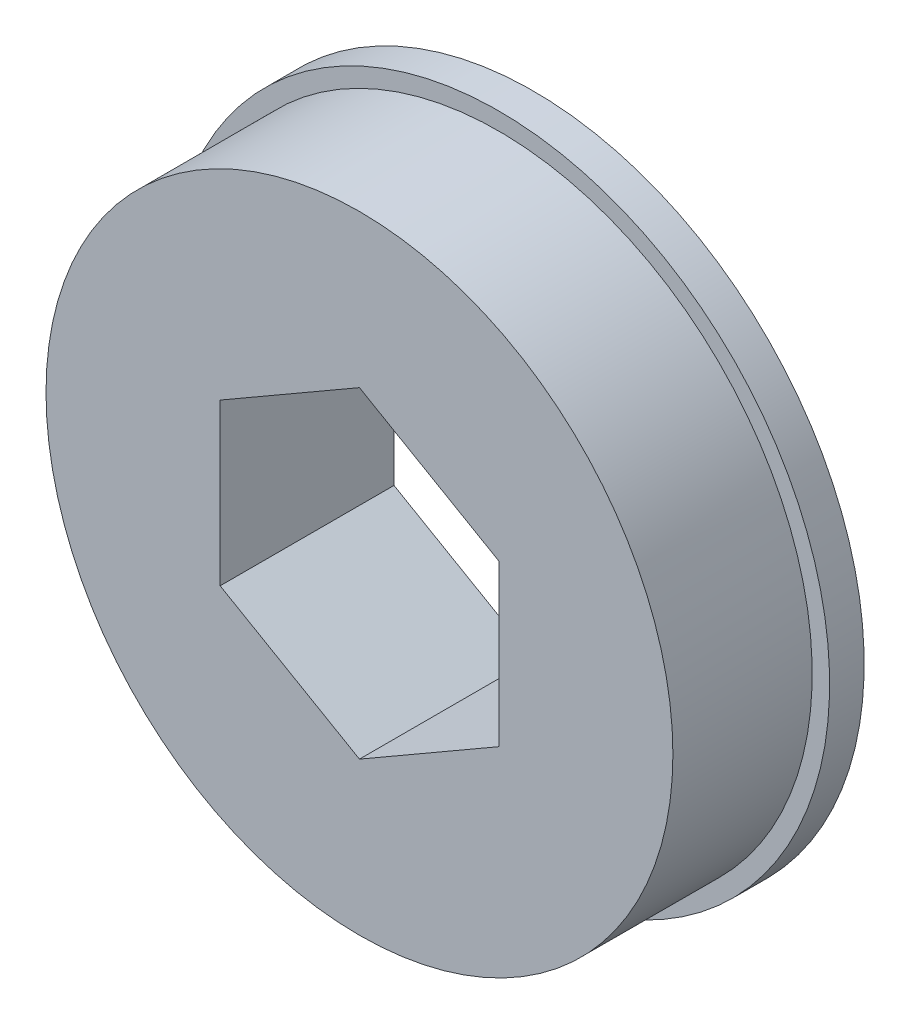
ISO-10303-21;
HEADER;
FILE_DESCRIPTION(('STEP AP214'),'2;1');
FILE_NAME('part.step','',(''),(''),'','','');
FILE_SCHEMA(('AUTOMOTIVE_DESIGN { 1 0 10303 214 1 1 1 1 }'));
ENDSEC;
DATA;
#1=APPLICATION_CONTEXT('core data for automotive mechanical design processes');
#2=APPLICATION_PROTOCOL_DEFINITION('international standard','automotive_design',2000,#1);
#3=PRODUCT_CONTEXT('',#1,'mechanical');
#4=PRODUCT('Part','Part','',(#3));
#5=PRODUCT_RELATED_PRODUCT_CATEGORY('part','',(#4));
#6=PRODUCT_DEFINITION_FORMATION('','',#4);
#7=PRODUCT_DEFINITION_CONTEXT('part definition',#1,'design');
#8=PRODUCT_DEFINITION('design','',#6,#7);
#9=PRODUCT_DEFINITION_SHAPE('','',#8);
#10=(LENGTH_UNIT() NAMED_UNIT(*) SI_UNIT(.MILLI.,.METRE.));
#11=(NAMED_UNIT(*) PLANE_ANGLE_UNIT() SI_UNIT($,.RADIAN.));
#12=(NAMED_UNIT(*) SI_UNIT($,.STERADIAN.) SOLID_ANGLE_UNIT());
#13=UNCERTAINTY_MEASURE_WITH_UNIT(LENGTH_MEASURE(1.E-05),#10,'distance_accuracy_value','');
#14=(GEOMETRIC_REPRESENTATION_CONTEXT(3) GLOBAL_UNCERTAINTY_ASSIGNED_CONTEXT((#13)) GLOBAL_UNIT_ASSIGNED_CONTEXT((#10,
#11,#12)) REPRESENTATION_CONTEXT('',''));
#15=CARTESIAN_POINT('',(0.,0.,0.));
#16=DIRECTION('',(0.,0.,1.));
#17=DIRECTION('',(1.,0.,0.));
#18=AXIS2_PLACEMENT_3D('',#15,#16,#17);
#19=CARTESIAN_POINT('',(0.,0.,6.35));
#20=DIRECTION('',(0.,0.,1.));
#21=DIRECTION('',(1.,0.,0.));
#22=AXIS2_PLACEMENT_3D('',#19,#20,#21);
#23=PLANE('',#22);
#24=CARTESIAN_POINT('',(0.,0.,6.35));
#25=DIRECTION('',(0.,0.,1.));
#26=DIRECTION('',(1.,0.,0.));
#27=AXIS2_PLACEMENT_3D('',#24,#25,#26);
#28=CIRCLE('',#27,14.2875);
#29=CARTESIAN_POINT('',(14.2875,0.,6.35));
#30=VERTEX_POINT('',#29);
#31=EDGE_CURVE('E11',#30,#30,#28,.T.);
#32=ORIENTED_EDGE('',*,*,#31,.T.);
#33=EDGE_LOOP('',(#32));
#34=FACE_BOUND('',#33,.T.);
#35=DIRECTION('',(-0.866025403784439,0.5,0.));
#36=VECTOR('',#35,1.);
#37=CARTESIAN_POINT('',(6.35,3.66617420935412,6.35));
#38=LINE('',#37,#36);
#39=CARTESIAN_POINT('',(6.35,3.66617420935412,6.35));
#40=VERTEX_POINT('',#39);
#41=CARTESIAN_POINT('',(0.,7.33234841870825,6.35));
#42=VERTEX_POINT('',#41);
#43=EDGE_CURVE('E93',#40,#42,#38,.T.);
#44=ORIENTED_EDGE('',*,*,#43,.F.);
#45=DIRECTION('',(0.,1.,0.));
#46=VECTOR('',#45,1.);
#47=CARTESIAN_POINT('',(6.35,-3.66617420935412,6.35));
#48=LINE('',#47,#46);
#49=CARTESIAN_POINT('',(6.35,-3.66617420935412,6.35));
#50=VERTEX_POINT('',#49);
#51=EDGE_CURVE('E129',#50,#40,#48,.T.);
#52=ORIENTED_EDGE('',*,*,#51,.F.);
#53=DIRECTION('',(0.866025403784438,0.5,0.));
#54=VECTOR('',#53,1.);
#55=CARTESIAN_POINT('',(0.,-7.33234841870825,6.35));
#56=LINE('',#55,#54);
#57=CARTESIAN_POINT('',(0.,-7.33234841870825,6.35));
#58=VERTEX_POINT('',#57);
#59=EDGE_CURVE('E53',#58,#50,#56,.T.);
#60=ORIENTED_EDGE('',*,*,#59,.F.);
#61=DIRECTION('',(0.866025403784439,-0.5,0.));
#62=VECTOR('',#61,1.);
#63=CARTESIAN_POINT('',(-6.35,-3.66617420935413,6.35));
#64=LINE('',#63,#62);
#65=CARTESIAN_POINT('',(-6.35,-3.66617420935413,6.35));
#66=VERTEX_POINT('',#65);
#67=EDGE_CURVE('E136',#66,#58,#64,.T.);
#68=ORIENTED_EDGE('',*,*,#67,.F.);
#69=DIRECTION('',(0.,-1.,0.));
#70=VECTOR('',#69,1.);
#71=CARTESIAN_POINT('',(-6.35,3.66617420935412,6.35));
#72=LINE('',#71,#70);
#73=CARTESIAN_POINT('',(-6.35,3.66617420935412,6.35));
#74=VERTEX_POINT('',#73);
#75=EDGE_CURVE('E134',#74,#66,#72,.T.);
#76=ORIENTED_EDGE('',*,*,#75,.F.);
#77=DIRECTION('',(-0.866025403784438,-0.500000000000001,0.));
#78=VECTOR('',#77,1.);
#79=CARTESIAN_POINT('',(0.,7.33234841870825,6.35));
#80=LINE('',#79,#78);
#81=EDGE_CURVE('E132',#42,#74,#80,.T.);
#82=ORIENTED_EDGE('',*,*,#81,.F.);
#83=EDGE_LOOP('',(#44,#52,#60,#68,#76,#82));
#84=FACE_BOUND('',#83,.T.);
#85=ADVANCED_FACE('F33',(#34,#84),#23,.T.);
#86=CARTESIAN_POINT('',(0.,0.,6.35));
#87=DIRECTION('',(0.,0.,-1.));
#88=DIRECTION('',(-1.,0.,0.));
#89=AXIS2_PLACEMENT_3D('',#86,#87,#88);
#90=CYLINDRICAL_SURFACE('',#89,14.2875);
#91=ORIENTED_EDGE('',*,*,#31,.F.);
#92=EDGE_LOOP('',(#91));
#93=FACE_BOUND('',#92,.T.);
#94=CARTESIAN_POINT('',(0.,0.,0.));
#95=DIRECTION('',(0.,0.,-1.));
#96=DIRECTION('',(-1.,0.,0.));
#97=AXIS2_PLACEMENT_3D('',#94,#95,#96);
#98=CIRCLE('',#97,14.2875);
#99=CARTESIAN_POINT('',(-14.2875,0.,0.));
#100=VERTEX_POINT('',#99);
#101=EDGE_CURVE('E124',#100,#100,#98,.T.);
#102=ORIENTED_EDGE('',*,*,#101,.F.);
#103=EDGE_LOOP('',(#102));
#104=FACE_BOUND('',#103,.T.);
#105=ADVANCED_FACE('F35',(#93,#104),#90,.T.);
#106=CARTESIAN_POINT('',(6.35,-3.66617420935412,6.35));
#107=DIRECTION('',(-1.,0.,0.));
#108=DIRECTION('',(0.,-1.,0.));
#109=AXIS2_PLACEMENT_3D('',#106,#107,#108);
#110=PLANE('',#109);
#111=DIRECTION('',(0.,0.,-1.));
#112=VECTOR('',#111,1.);
#113=CARTESIAN_POINT('',(6.35,3.66617420935412,6.35));
#114=LINE('',#113,#112);
#115=CARTESIAN_POINT('',(6.35,3.66617420935412,-1.5748));
#116=VERTEX_POINT('',#115);
#117=EDGE_CURVE('E41',#40,#116,#114,.T.);
#118=ORIENTED_EDGE('',*,*,#117,.T.);
#119=DIRECTION('',(0.,-1.,0.));
#120=VECTOR('',#119,1.);
#121=CARTESIAN_POINT('',(6.35,3.66617420935412,-1.5748));
#122=LINE('',#121,#120);
#123=CARTESIAN_POINT('',(6.35,-3.66617420935412,-1.5748));
#124=VERTEX_POINT('',#123);
#125=EDGE_CURVE('E109',#116,#124,#122,.T.);
#126=ORIENTED_EDGE('',*,*,#125,.T.);
#127=DIRECTION('',(0.,0.,-1.));
#128=VECTOR('',#127,1.);
#129=CARTESIAN_POINT('',(6.35,-3.66617420935412,6.35));
#130=LINE('',#129,#128);
#131=EDGE_CURVE('E139',#50,#124,#130,.T.);
#132=ORIENTED_EDGE('',*,*,#131,.F.);
#133=ORIENTED_EDGE('',*,*,#51,.T.);
#134=EDGE_LOOP('',(#118,#126,#132,#133));
#135=FACE_BOUND('',#134,.T.);
#136=ADVANCED_FACE('F145',(#135),#110,.T.);
#137=CARTESIAN_POINT('',(6.35,3.66617420935412,6.35));
#138=DIRECTION('',(-0.5,-0.866025403784439,0.));
#139=DIRECTION('',(0.866025403784439,-0.5,0.));
#140=AXIS2_PLACEMENT_3D('',#137,#138,#139);
#141=PLANE('',#140);
#142=DIRECTION('',(0.,0.,-1.));
#143=VECTOR('',#142,1.);
#144=CARTESIAN_POINT('',(0.,7.33234841870825,6.35));
#145=LINE('',#144,#143);
#146=CARTESIAN_POINT('',(0.,7.33234841870825,-1.5748));
#147=VERTEX_POINT('',#146);
#148=EDGE_CURVE('E85',#42,#147,#145,.T.);
#149=ORIENTED_EDGE('',*,*,#148,.T.);
#150=DIRECTION('',(0.866025403784439,-0.5,0.));
#151=VECTOR('',#150,1.);
#152=CARTESIAN_POINT('',(0.,7.33234841870825,-1.5748));
#153=LINE('',#152,#151);
#154=EDGE_CURVE('E90',#147,#116,#153,.T.);
#155=ORIENTED_EDGE('',*,*,#154,.T.);
#156=ORIENTED_EDGE('',*,*,#117,.F.);
#157=ORIENTED_EDGE('',*,*,#43,.T.);
#158=EDGE_LOOP('',(#149,#155,#156,#157));
#159=FACE_BOUND('',#158,.T.);
#160=ADVANCED_FACE('F87',(#159),#141,.T.);
#161=CARTESIAN_POINT('',(0.,7.33234841870825,6.35));
#162=DIRECTION('',(0.500000000000001,-0.866025403784438,0.));
#163=DIRECTION('',(0.866025403784438,0.500000000000001,0.));
#164=AXIS2_PLACEMENT_3D('',#161,#162,#163);
#165=PLANE('',#164);
#166=DIRECTION('',(0.,0.,-1.));
#167=VECTOR('',#166,1.);
#168=CARTESIAN_POINT('',(-6.35,3.66617420935412,6.35));
#169=LINE('',#168,#167);
#170=CARTESIAN_POINT('',(-6.35,3.66617420935412,-1.5748));
#171=VERTEX_POINT('',#170);
#172=EDGE_CURVE('E96',#74,#171,#169,.T.);
#173=ORIENTED_EDGE('',*,*,#172,.T.);
#174=DIRECTION('',(0.866025403784439,0.5,0.));
#175=VECTOR('',#174,1.);
#176=CARTESIAN_POINT('',(-6.35,3.66617420935412,-1.5748));
#177=LINE('',#176,#175);
#178=EDGE_CURVE('E99',#171,#147,#177,.T.);
#179=ORIENTED_EDGE('',*,*,#178,.T.);
#180=ORIENTED_EDGE('',*,*,#148,.F.);
#181=ORIENTED_EDGE('',*,*,#81,.T.);
#182=EDGE_LOOP('',(#173,#179,#180,#181));
#183=FACE_BOUND('',#182,.T.);
#184=ADVANCED_FACE('F100',(#183),#165,.T.);
#185=CARTESIAN_POINT('',(-6.35,3.66617420935412,6.35));
#186=DIRECTION('',(1.,0.,0.));
#187=DIRECTION('',(0.,1.,0.));
#188=AXIS2_PLACEMENT_3D('',#185,#186,#187);
#189=PLANE('',#188);
#190=DIRECTION('',(0.,0.,-1.));
#191=VECTOR('',#190,1.);
#192=CARTESIAN_POINT('',(-6.35,-3.66617420935413,6.35));
#193=LINE('',#192,#191);
#194=CARTESIAN_POINT('',(-6.35,-3.66617420935412,-1.5748));
#195=VERTEX_POINT('',#194);
#196=EDGE_CURVE('E142',#66,#195,#193,.T.);
#197=ORIENTED_EDGE('',*,*,#196,.T.);
#198=DIRECTION('',(0.,1.,0.));
#199=VECTOR('',#198,1.);
#200=CARTESIAN_POINT('',(-6.35,-3.66617420935412,-1.5748));
#201=LINE('',#200,#199);
#202=EDGE_CURVE('E118',#195,#171,#201,.T.);
#203=ORIENTED_EDGE('',*,*,#202,.T.);
#204=ORIENTED_EDGE('',*,*,#172,.F.);
#205=ORIENTED_EDGE('',*,*,#75,.T.);
#206=EDGE_LOOP('',(#197,#203,#204,#205));
#207=FACE_BOUND('',#206,.T.);
#208=ADVANCED_FACE('F151',(#207),#189,.T.);
#209=CARTESIAN_POINT('',(-6.35,-3.66617420935413,6.35));
#210=DIRECTION('',(0.5,0.866025403784439,0.));
#211=DIRECTION('',(-0.866025403784439,0.5,0.));
#212=AXIS2_PLACEMENT_3D('',#209,#210,#211);
#213=PLANE('',#212);
#214=DIRECTION('',(0.,0.,-1.));
#215=VECTOR('',#214,1.);
#216=CARTESIAN_POINT('',(0.,-7.33234841870825,6.35));
#217=LINE('',#216,#215);
#218=CARTESIAN_POINT('',(0.,-7.33234841870825,-1.5748));
#219=VERTEX_POINT('',#218);
#220=EDGE_CURVE('E48',#58,#219,#217,.T.);
#221=ORIENTED_EDGE('',*,*,#220,.T.);
#222=DIRECTION('',(-0.866025403784439,0.5,0.));
#223=VECTOR('',#222,1.);
#224=CARTESIAN_POINT('',(0.,-7.33234841870825,-1.5748));
#225=LINE('',#224,#223);
#226=EDGE_CURVE('E115',#219,#195,#225,.T.);
#227=ORIENTED_EDGE('',*,*,#226,.T.);
#228=ORIENTED_EDGE('',*,*,#196,.F.);
#229=ORIENTED_EDGE('',*,*,#67,.T.);
#230=EDGE_LOOP('',(#221,#227,#228,#229));
#231=FACE_BOUND('',#230,.T.);
#232=ADVANCED_FACE('F155',(#231),#213,.T.);
#233=CARTESIAN_POINT('',(0.,-7.33234841870825,6.35));
#234=DIRECTION('',(-0.5,0.866025403784438,0.));
#235=DIRECTION('',(-0.866025403784439,-0.5,0.));
#236=AXIS2_PLACEMENT_3D('',#233,#234,#235);
#237=PLANE('',#236);
#238=ORIENTED_EDGE('',*,*,#131,.T.);
#239=DIRECTION('',(-0.866025403784439,-0.5,0.));
#240=VECTOR('',#239,1.);
#241=CARTESIAN_POINT('',(6.35,-3.66617420935412,-1.5748));
#242=LINE('',#241,#240);
#243=EDGE_CURVE('E111',#124,#219,#242,.T.);
#244=ORIENTED_EDGE('',*,*,#243,.T.);
#245=ORIENTED_EDGE('',*,*,#220,.F.);
#246=ORIENTED_EDGE('',*,*,#59,.T.);
#247=EDGE_LOOP('',(#238,#244,#245,#246));
#248=FACE_BOUND('',#247,.T.);
#249=ADVANCED_FACE('F156',(#248),#237,.T.);
#250=CARTESIAN_POINT('',(0.,0.,0.));
#251=DIRECTION('',(0.,0.,-1.));
#252=DIRECTION('',(-1.,0.,0.));
#253=AXIS2_PLACEMENT_3D('',#250,#251,#252);
#254=PLANE('',#253);
#255=CARTESIAN_POINT('',(0.,0.,0.));
#256=DIRECTION('',(0.,0.,-1.));
#257=DIRECTION('',(-1.,0.,0.));
#258=AXIS2_PLACEMENT_3D('',#255,#256,#257);
#259=CIRCLE('',#258,15.08125);
#260=CARTESIAN_POINT('',(-15.08125,0.,0.));
#261=VERTEX_POINT('',#260);
#262=EDGE_CURVE('E120',#261,#261,#259,.T.);
#263=ORIENTED_EDGE('',*,*,#262,.F.);
#264=EDGE_LOOP('',(#263));
#265=FACE_BOUND('',#264,.T.);
#266=ORIENTED_EDGE('',*,*,#101,.T.);
#267=EDGE_LOOP('',(#266));
#268=FACE_BOUND('',#267,.T.);
#269=ADVANCED_FACE('F158',(#265,#268),#254,.F.);
#270=CARTESIAN_POINT('',(0.,0.,-1.5748));
#271=DIRECTION('',(0.,0.,-1.));
#272=DIRECTION('',(-1.,0.,0.));
#273=AXIS2_PLACEMENT_3D('',#270,#271,#272);
#274=PLANE('',#273);
#275=CARTESIAN_POINT('',(0.,0.,-1.5748));
#276=DIRECTION('',(0.,0.,-1.));
#277=DIRECTION('',(-1.,0.,0.));
#278=AXIS2_PLACEMENT_3D('',#275,#276,#277);
#279=CIRCLE('',#278,15.08125);
#280=CARTESIAN_POINT('',(-15.08125,0.,-1.5748));
#281=VERTEX_POINT('',#280);
#282=EDGE_CURVE('E121',#281,#281,#279,.T.);
#283=ORIENTED_EDGE('',*,*,#282,.T.);
#284=EDGE_LOOP('',(#283));
#285=FACE_BOUND('',#284,.T.);
#286=ORIENTED_EDGE('',*,*,#154,.F.);
#287=ORIENTED_EDGE('',*,*,#178,.F.);
#288=ORIENTED_EDGE('',*,*,#202,.F.);
#289=ORIENTED_EDGE('',*,*,#226,.F.);
#290=ORIENTED_EDGE('',*,*,#243,.F.);
#291=ORIENTED_EDGE('',*,*,#125,.F.);
#292=EDGE_LOOP('',(#286,#287,#288,#289,#290,#291));
#293=FACE_BOUND('',#292,.T.);
#294=ADVANCED_FACE('F106',(#285,#293),#274,.T.);
#295=CARTESIAN_POINT('',(0.,0.,-1.5748));
#296=DIRECTION('',(0.,0.,1.));
#297=DIRECTION('',(1.,0.,0.));
#298=AXIS2_PLACEMENT_3D('',#295,#296,#297);
#299=CYLINDRICAL_SURFACE('',#298,15.08125);
#300=ORIENTED_EDGE('',*,*,#282,.F.);
#301=EDGE_LOOP('',(#300));
#302=FACE_BOUND('',#301,.T.);
#303=ORIENTED_EDGE('',*,*,#262,.T.);
#304=EDGE_LOOP('',(#303));
#305=FACE_BOUND('',#304,.T.);
#306=ADVANCED_FACE('F211',(#302,#305),#299,.T.);
#307=CLOSED_SHELL('',(#85,#105,#136,#160,#184,#208,#232,#249,#269,#294,#306));
#308=MANIFOLD_SOLID_BREP('B2',#307);
#309=ADVANCED_BREP_SHAPE_REPRESENTATION('',(#18,#308),#14);
#310=SHAPE_DEFINITION_REPRESENTATION(#9,#309);
ENDSEC;
END-ISO-10303-21;
